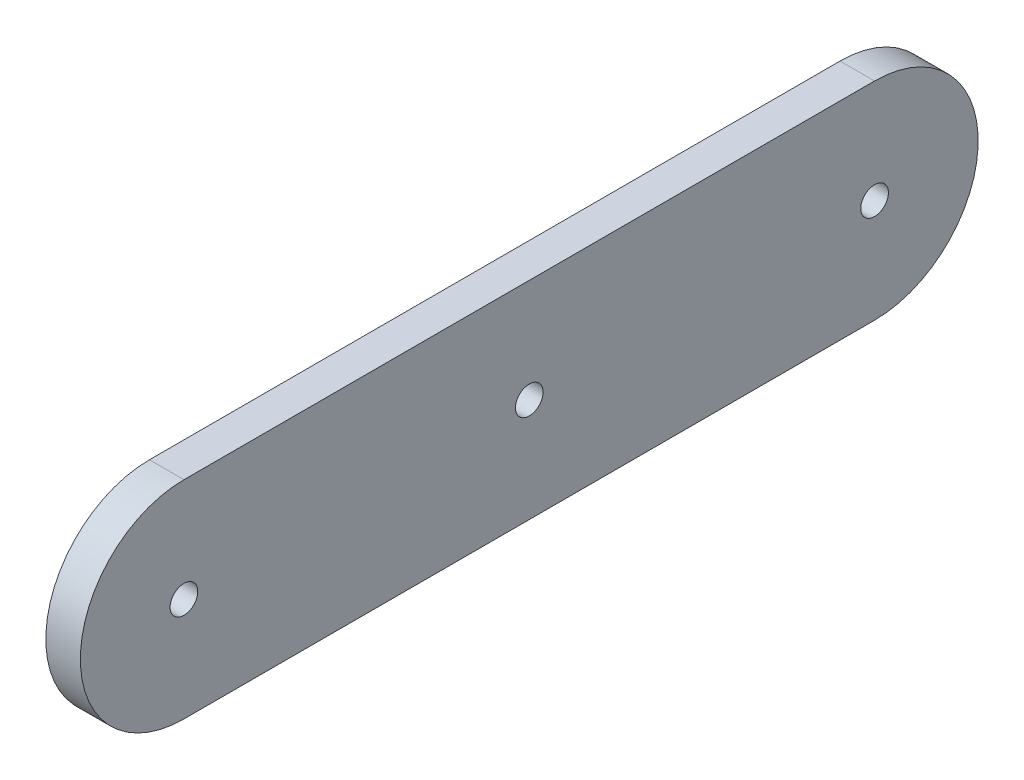
ISO-10303-21;
HEADER;
FILE_DESCRIPTION(('STEP AP214'),'2;1');
FILE_NAME('part.step','',(''),(''),'','','');
FILE_SCHEMA(('AUTOMOTIVE_DESIGN { 1 0 10303 214 1 1 1 1 }'));
ENDSEC;
DATA;
#1=APPLICATION_CONTEXT('core data for automotive mechanical design processes');
#2=APPLICATION_PROTOCOL_DEFINITION('international standard','automotive_design',2000,#1);
#3=PRODUCT_CONTEXT('',#1,'mechanical');
#4=PRODUCT('Part','Part','',(#3));
#5=PRODUCT_RELATED_PRODUCT_CATEGORY('part','',(#4));
#6=PRODUCT_DEFINITION_FORMATION('','',#4);
#7=PRODUCT_DEFINITION_CONTEXT('part definition',#1,'design');
#8=PRODUCT_DEFINITION('design','',#6,#7);
#9=PRODUCT_DEFINITION_SHAPE('','',#8);
#10=(LENGTH_UNIT() NAMED_UNIT(*) SI_UNIT(.MILLI.,.METRE.));
#11=(NAMED_UNIT(*) PLANE_ANGLE_UNIT() SI_UNIT($,.RADIAN.));
#12=(NAMED_UNIT(*) SI_UNIT($,.STERADIAN.) SOLID_ANGLE_UNIT());
#13=UNCERTAINTY_MEASURE_WITH_UNIT(LENGTH_MEASURE(1.E-05),#10,'distance_accuracy_value','');
#14=(GEOMETRIC_REPRESENTATION_CONTEXT(3) GLOBAL_UNCERTAINTY_ASSIGNED_CONTEXT((#13)) GLOBAL_UNIT_ASSIGNED_CONTEXT((#10,
#11,#12)) REPRESENTATION_CONTEXT('',''));
#15=CARTESIAN_POINT('',(0.,0.,0.));
#16=DIRECTION('',(0.,0.,1.));
#17=DIRECTION('',(1.,0.,0.));
#18=AXIS2_PLACEMENT_3D('',#15,#16,#17);
#19=CARTESIAN_POINT('',(5.,0.,-50.));
#20=DIRECTION('',(-1.,0.,0.));
#21=DIRECTION('',(0.,0.,-1.));
#22=AXIS2_PLACEMENT_3D('',#19,#20,#21);
#23=CYLINDRICAL_SURFACE('',#22,15.);
#24=CARTESIAN_POINT('',(0.,0.,-50.));
#25=DIRECTION('',(-1.,0.,0.));
#26=DIRECTION('',(0.,0.,1.));
#27=AXIS2_PLACEMENT_3D('',#24,#25,#26);
#28=CIRCLE('',#27,15.);
#29=CARTESIAN_POINT('',(0.,15.,-50.));
#30=VERTEX_POINT('',#29);
#31=CARTESIAN_POINT('',(0.,-15.,-50.));
#32=VERTEX_POINT('',#31);
#33=EDGE_CURVE('E103',#30,#32,#28,.T.);
#34=ORIENTED_EDGE('',*,*,#33,.F.);
#35=DIRECTION('',(-1.,0.,0.));
#36=VECTOR('',#35,1.);
#37=CARTESIAN_POINT('',(5.,15.,-50.));
#38=LINE('',#37,#36);
#39=CARTESIAN_POINT('',(5.,15.,-50.));
#40=VERTEX_POINT('',#39);
#41=EDGE_CURVE('E102',#40,#30,#38,.T.);
#42=ORIENTED_EDGE('',*,*,#41,.F.);
#43=CARTESIAN_POINT('',(5.,0.,-50.));
#44=DIRECTION('',(-1.,0.,0.));
#45=DIRECTION('',(0.,0.,1.));
#46=AXIS2_PLACEMENT_3D('',#43,#44,#45);
#47=CIRCLE('',#46,15.);
#48=CARTESIAN_POINT('',(5.,-15.,-50.));
#49=VERTEX_POINT('',#48);
#50=EDGE_CURVE('E96',#40,#49,#47,.T.);
#51=ORIENTED_EDGE('',*,*,#50,.T.);
#52=DIRECTION('',(-1.,0.,0.));
#53=VECTOR('',#52,1.);
#54=CARTESIAN_POINT('',(5.,-15.,-50.));
#55=LINE('',#54,#53);
#56=EDGE_CURVE('E11',#49,#32,#55,.T.);
#57=ORIENTED_EDGE('',*,*,#56,.T.);
#58=EDGE_LOOP('',(#34,#42,#51,#57));
#59=FACE_BOUND('',#58,.T.);
#60=ADVANCED_FACE('F39',(#59),#23,.T.);
#61=CARTESIAN_POINT('',(5.,-15.,-50.));
#62=DIRECTION('',(0.,1.,0.));
#63=DIRECTION('',(0.,0.,-1.));
#64=AXIS2_PLACEMENT_3D('',#61,#62,#63);
#65=PLANE('',#64);
#66=DIRECTION('',(0.,0.,1.));
#67=VECTOR('',#66,1.);
#68=CARTESIAN_POINT('',(0.,-15.,-50.));
#69=LINE('',#68,#67);
#70=CARTESIAN_POINT('',(0.,-15.,50.));
#71=VERTEX_POINT('',#70);
#72=EDGE_CURVE('E105',#32,#71,#69,.T.);
#73=ORIENTED_EDGE('',*,*,#72,.F.);
#74=ORIENTED_EDGE('',*,*,#56,.F.);
#75=DIRECTION('',(0.,0.,1.));
#76=VECTOR('',#75,1.);
#77=CARTESIAN_POINT('',(5.,-15.,-50.));
#78=LINE('',#77,#76);
#79=CARTESIAN_POINT('',(5.,-15.,50.));
#80=VERTEX_POINT('',#79);
#81=EDGE_CURVE('E80',#49,#80,#78,.T.);
#82=ORIENTED_EDGE('',*,*,#81,.T.);
#83=DIRECTION('',(-1.,0.,0.));
#84=VECTOR('',#83,1.);
#85=CARTESIAN_POINT('',(5.,-15.,50.));
#86=LINE('',#85,#84);
#87=EDGE_CURVE('E47',#80,#71,#86,.T.);
#88=ORIENTED_EDGE('',*,*,#87,.T.);
#89=EDGE_LOOP('',(#73,#74,#82,#88));
#90=FACE_BOUND('',#89,.T.);
#91=ADVANCED_FACE('F94',(#90),#65,.F.);
#92=CARTESIAN_POINT('',(5.,0.,50.));
#93=DIRECTION('',(-1.,0.,0.));
#94=DIRECTION('',(0.,0.,-1.));
#95=AXIS2_PLACEMENT_3D('',#92,#93,#94);
#96=CYLINDRICAL_SURFACE('',#95,15.);
#97=CARTESIAN_POINT('',(0.,0.,50.));
#98=DIRECTION('',(-1.,0.,0.));
#99=DIRECTION('',(0.,0.,-1.));
#100=AXIS2_PLACEMENT_3D('',#97,#98,#99);
#101=CIRCLE('',#100,15.);
#102=CARTESIAN_POINT('',(0.,15.,50.));
#103=VERTEX_POINT('',#102);
#104=EDGE_CURVE('E90',#71,#103,#101,.T.);
#105=ORIENTED_EDGE('',*,*,#104,.F.);
#106=ORIENTED_EDGE('',*,*,#87,.F.);
#107=CARTESIAN_POINT('',(5.,0.,50.));
#108=DIRECTION('',(-1.,0.,0.));
#109=DIRECTION('',(0.,0.,-1.));
#110=AXIS2_PLACEMENT_3D('',#107,#108,#109);
#111=CIRCLE('',#110,15.);
#112=CARTESIAN_POINT('',(5.,15.,50.));
#113=VERTEX_POINT('',#112);
#114=EDGE_CURVE('E83',#80,#113,#111,.T.);
#115=ORIENTED_EDGE('',*,*,#114,.T.);
#116=DIRECTION('',(-1.,0.,0.));
#117=VECTOR('',#116,1.);
#118=CARTESIAN_POINT('',(5.,15.,50.));
#119=LINE('',#118,#117);
#120=EDGE_CURVE('E93',#113,#103,#119,.T.);
#121=ORIENTED_EDGE('',*,*,#120,.T.);
#122=EDGE_LOOP('',(#105,#106,#115,#121));
#123=FACE_BOUND('',#122,.T.);
#124=ADVANCED_FACE('F89',(#123),#96,.T.);
#125=CARTESIAN_POINT('',(5.,15.,-50.));
#126=DIRECTION('',(0.,-1.,0.));
#127=DIRECTION('',(0.,0.,1.));
#128=AXIS2_PLACEMENT_3D('',#125,#126,#127);
#129=PLANE('',#128);
#130=DIRECTION('',(0.,0.,-1.));
#131=VECTOR('',#130,1.);
#132=CARTESIAN_POINT('',(0.,15.,-50.));
#133=LINE('',#132,#131);
#134=EDGE_CURVE('E69',#103,#30,#133,.T.);
#135=ORIENTED_EDGE('',*,*,#134,.F.);
#136=ORIENTED_EDGE('',*,*,#120,.F.);
#137=DIRECTION('',(0.,0.,-1.));
#138=VECTOR('',#137,1.);
#139=CARTESIAN_POINT('',(5.,15.,-50.));
#140=LINE('',#139,#138);
#141=EDGE_CURVE('E55',#113,#40,#140,.T.);
#142=ORIENTED_EDGE('',*,*,#141,.T.);
#143=ORIENTED_EDGE('',*,*,#41,.T.);
#144=EDGE_LOOP('',(#135,#136,#142,#143));
#145=FACE_BOUND('',#144,.T.);
#146=ADVANCED_FACE('F115',(#145),#129,.F.);
#147=CARTESIAN_POINT('',(5.,0.,-50.));
#148=DIRECTION('',(1.,0.,0.));
#149=DIRECTION('',(0.,0.,1.));
#150=AXIS2_PLACEMENT_3D('',#147,#148,#149);
#151=PLANE('',#150);
#152=CARTESIAN_POINT('',(5.,0.,50.));
#153=DIRECTION('',(-1.,0.,0.));
#154=DIRECTION('',(0.,0.,1.));
#155=AXIS2_PLACEMENT_3D('',#152,#153,#154);
#156=CIRCLE('',#155,2.);
#157=CARTESIAN_POINT('',(5.,0.,52.));
#158=VERTEX_POINT('',#157);
#159=EDGE_CURVE('E194',#158,#158,#156,.T.);
#160=ORIENTED_EDGE('',*,*,#159,.T.);
#161=EDGE_LOOP('',(#160));
#162=FACE_BOUND('',#161,.T.);
#163=CARTESIAN_POINT('',(5.,0.,0.));
#164=DIRECTION('',(-1.,0.,0.));
#165=DIRECTION('',(0.,0.,1.));
#166=AXIS2_PLACEMENT_3D('',#163,#164,#165);
#167=CIRCLE('',#166,2.);
#168=CARTESIAN_POINT('',(5.,0.,2.));
#169=VERTEX_POINT('',#168);
#170=EDGE_CURVE('E196',#169,#169,#167,.T.);
#171=ORIENTED_EDGE('',*,*,#170,.T.);
#172=EDGE_LOOP('',(#171));
#173=FACE_BOUND('',#172,.T.);
#174=CARTESIAN_POINT('',(5.,0.,-50.));
#175=DIRECTION('',(-1.,0.,0.));
#176=DIRECTION('',(0.,0.,1.));
#177=AXIS2_PLACEMENT_3D('',#174,#175,#176);
#178=CIRCLE('',#177,2.);
#179=CARTESIAN_POINT('',(5.,0.,-48.));
#180=VERTEX_POINT('',#179);
#181=EDGE_CURVE('E202',#180,#180,#178,.T.);
#182=ORIENTED_EDGE('',*,*,#181,.T.);
#183=EDGE_LOOP('',(#182));
#184=FACE_BOUND('',#183,.T.);
#185=ORIENTED_EDGE('',*,*,#50,.F.);
#186=ORIENTED_EDGE('',*,*,#141,.F.);
#187=ORIENTED_EDGE('',*,*,#114,.F.);
#188=ORIENTED_EDGE('',*,*,#81,.F.);
#189=EDGE_LOOP('',(#185,#186,#187,#188));
#190=FACE_BOUND('',#189,.T.);
#191=ADVANCED_FACE('F85',(#162,#173,#184,#190),#151,.T.);
#192=CARTESIAN_POINT('',(0.,0.,-50.));
#193=DIRECTION('',(1.,0.,0.));
#194=DIRECTION('',(0.,0.,1.));
#195=AXIS2_PLACEMENT_3D('',#192,#193,#194);
#196=PLANE('',#195);
#197=CARTESIAN_POINT('',(0.,0.,50.));
#198=DIRECTION('',(-1.,0.,0.));
#199=DIRECTION('',(0.,0.,1.));
#200=AXIS2_PLACEMENT_3D('',#197,#198,#199);
#201=CIRCLE('',#200,2.);
#202=CARTESIAN_POINT('',(0.,0.,52.));
#203=VERTEX_POINT('',#202);
#204=EDGE_CURVE('E191',#203,#203,#201,.T.);
#205=ORIENTED_EDGE('',*,*,#204,.F.);
#206=EDGE_LOOP('',(#205));
#207=FACE_BOUND('',#206,.T.);
#208=CARTESIAN_POINT('',(0.,0.,0.));
#209=DIRECTION('',(-1.,0.,0.));
#210=DIRECTION('',(0.,0.,1.));
#211=AXIS2_PLACEMENT_3D('',#208,#209,#210);
#212=CIRCLE('',#211,2.);
#213=CARTESIAN_POINT('',(0.,0.,2.));
#214=VERTEX_POINT('',#213);
#215=EDGE_CURVE('E199',#214,#214,#212,.T.);
#216=ORIENTED_EDGE('',*,*,#215,.F.);
#217=EDGE_LOOP('',(#216));
#218=FACE_BOUND('',#217,.T.);
#219=CARTESIAN_POINT('',(0.,0.,-50.));
#220=DIRECTION('',(-1.,0.,0.));
#221=DIRECTION('',(0.,0.,1.));
#222=AXIS2_PLACEMENT_3D('',#219,#220,#221);
#223=CIRCLE('',#222,2.);
#224=CARTESIAN_POINT('',(0.,0.,-48.));
#225=VERTEX_POINT('',#224);
#226=EDGE_CURVE('E106',#225,#225,#223,.T.);
#227=ORIENTED_EDGE('',*,*,#226,.F.);
#228=EDGE_LOOP('',(#227));
#229=FACE_BOUND('',#228,.T.);
#230=ORIENTED_EDGE('',*,*,#33,.T.);
#231=ORIENTED_EDGE('',*,*,#72,.T.);
#232=ORIENTED_EDGE('',*,*,#104,.T.);
#233=ORIENTED_EDGE('',*,*,#134,.T.);
#234=EDGE_LOOP('',(#230,#231,#232,#233));
#235=FACE_BOUND('',#234,.T.);
#236=ADVANCED_FACE('F111',(#207,#218,#229,#235),#196,.F.);
#237=CARTESIAN_POINT('',(0.,0.,-50.));
#238=DIRECTION('',(1.,0.,0.));
#239=DIRECTION('',(0.,0.,1.));
#240=AXIS2_PLACEMENT_3D('',#237,#238,#239);
#241=CYLINDRICAL_SURFACE('',#240,2.);
#242=ORIENTED_EDGE('',*,*,#226,.T.);
#243=EDGE_LOOP('',(#242));
#244=FACE_BOUND('',#243,.T.);
#245=ORIENTED_EDGE('',*,*,#181,.F.);
#246=EDGE_LOOP('',(#245));
#247=FACE_BOUND('',#246,.T.);
#248=ADVANCED_FACE('F155',(#244,#247),#241,.F.);
#249=CARTESIAN_POINT('',(0.,0.,0.));
#250=DIRECTION('',(1.,0.,0.));
#251=DIRECTION('',(0.,0.,1.));
#252=AXIS2_PLACEMENT_3D('',#249,#250,#251);
#253=CYLINDRICAL_SURFACE('',#252,2.);
#254=ORIENTED_EDGE('',*,*,#215,.T.);
#255=EDGE_LOOP('',(#254));
#256=FACE_BOUND('',#255,.T.);
#257=ORIENTED_EDGE('',*,*,#170,.F.);
#258=EDGE_LOOP('',(#257));
#259=FACE_BOUND('',#258,.T.);
#260=ADVANCED_FACE('F164',(#256,#259),#253,.F.);
#261=CARTESIAN_POINT('',(0.,0.,50.));
#262=DIRECTION('',(1.,0.,0.));
#263=DIRECTION('',(0.,0.,1.));
#264=AXIS2_PLACEMENT_3D('',#261,#262,#263);
#265=CYLINDRICAL_SURFACE('',#264,2.);
#266=ORIENTED_EDGE('',*,*,#204,.T.);
#267=EDGE_LOOP('',(#266));
#268=FACE_BOUND('',#267,.T.);
#269=ORIENTED_EDGE('',*,*,#159,.F.);
#270=EDGE_LOOP('',(#269));
#271=FACE_BOUND('',#270,.T.);
#272=ADVANCED_FACE('F174',(#268,#271),#265,.F.);
#273=CLOSED_SHELL('',(#60,#91,#124,#146,#191,#236,#248,#260,#272));
#274=MANIFOLD_SOLID_BREP('B2',#273);
#275=ADVANCED_BREP_SHAPE_REPRESENTATION('',(#18,#274),#14);
#276=SHAPE_DEFINITION_REPRESENTATION(#9,#275);
ENDSEC;
END-ISO-10303-21;
